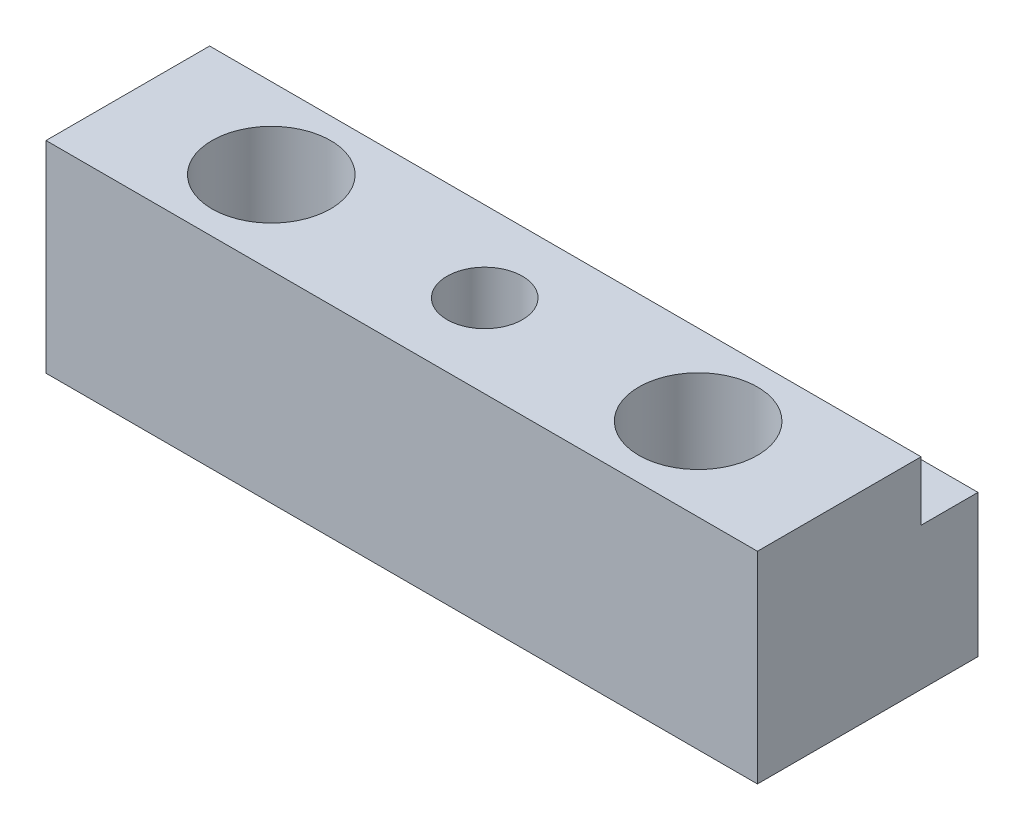
ISO-10303-21;
HEADER;
FILE_DESCRIPTION(('STEP AP214'),'2;1');
FILE_NAME('part.step','',(''),(''),'','','');
FILE_SCHEMA(('AUTOMOTIVE_DESIGN { 1 0 10303 214 1 1 1 1 }'));
ENDSEC;
DATA;
#1=APPLICATION_CONTEXT('core data for automotive mechanical design processes');
#2=APPLICATION_PROTOCOL_DEFINITION('international standard','automotive_design',2000,#1);
#3=PRODUCT_CONTEXT('',#1,'mechanical');
#4=PRODUCT('Part','Part','',(#3));
#5=PRODUCT_RELATED_PRODUCT_CATEGORY('part','',(#4));
#6=PRODUCT_DEFINITION_FORMATION('','',#4);
#7=PRODUCT_DEFINITION_CONTEXT('part definition',#1,'design');
#8=PRODUCT_DEFINITION('design','',#6,#7);
#9=PRODUCT_DEFINITION_SHAPE('','',#8);
#10=(LENGTH_UNIT() NAMED_UNIT(*) SI_UNIT(.MILLI.,.METRE.));
#11=(NAMED_UNIT(*) PLANE_ANGLE_UNIT() SI_UNIT($,.RADIAN.));
#12=(NAMED_UNIT(*) SI_UNIT($,.STERADIAN.) SOLID_ANGLE_UNIT());
#13=UNCERTAINTY_MEASURE_WITH_UNIT(LENGTH_MEASURE(1.E-05),#10,'distance_accuracy_value','');
#14=(GEOMETRIC_REPRESENTATION_CONTEXT(3) GLOBAL_UNCERTAINTY_ASSIGNED_CONTEXT((#13)) GLOBAL_UNIT_ASSIGNED_CONTEXT((#10,
#11,#12)) REPRESENTATION_CONTEXT('',''));
#15=CARTESIAN_POINT('',(0.,0.,0.));
#16=DIRECTION('',(0.,0.,1.));
#17=DIRECTION('',(1.,0.,0.));
#18=AXIS2_PLACEMENT_3D('',#15,#16,#17);
#19=CARTESIAN_POINT('',(0.,10.795,-11.811));
#20=DIRECTION('',(0.,0.,1.));
#21=DIRECTION('',(1.,0.,0.));
#22=AXIS2_PLACEMENT_3D('',#19,#20,#21);
#23=PLANE('',#22);
#24=DIRECTION('',(-1.,0.,0.));
#25=VECTOR('',#24,1.);
#26=CARTESIAN_POINT('',(0.,7.62,-11.811));
#27=LINE('',#26,#25);
#28=CARTESIAN_POINT('',(38.1,7.62,-11.811));
#29=VERTEX_POINT('',#28);
#30=CARTESIAN_POINT('',(0.,7.62,-11.811));
#31=VERTEX_POINT('',#30);
#32=EDGE_CURVE('E138',#29,#31,#27,.T.);
#33=ORIENTED_EDGE('',*,*,#32,.F.);
#34=DIRECTION('',(0.,-1.,0.));
#35=VECTOR('',#34,1.);
#36=CARTESIAN_POINT('',(38.1,10.795,-11.811));
#37=LINE('',#36,#35);
#38=CARTESIAN_POINT('',(38.1,0.,-11.811));
#39=VERTEX_POINT('',#38);
#40=EDGE_CURVE('E104',#29,#39,#37,.T.);
#41=ORIENTED_EDGE('',*,*,#40,.T.);
#42=DIRECTION('',(-1.,0.,0.));
#43=VECTOR('',#42,1.);
#44=CARTESIAN_POINT('',(0.,0.,-11.811));
#45=LINE('',#44,#43);
#46=CARTESIAN_POINT('',(0.,0.,-11.811));
#47=VERTEX_POINT('',#46);
#48=EDGE_CURVE('E108',#39,#47,#45,.T.);
#49=ORIENTED_EDGE('',*,*,#48,.T.);
#50=DIRECTION('',(0.,-1.,0.));
#51=VECTOR('',#50,1.);
#52=CARTESIAN_POINT('',(0.,10.795,-11.811));
#53=LINE('',#52,#51);
#54=EDGE_CURVE('E94',#31,#47,#53,.T.);
#55=ORIENTED_EDGE('',*,*,#54,.F.);
#56=EDGE_LOOP('',(#33,#41,#49,#55));
#57=FACE_BOUND('',#56,.T.);
#58=ADVANCED_FACE('F50',(#57),#23,.F.);
#59=CARTESIAN_POINT('',(0.,10.795,0.));
#60=DIRECTION('',(1.,0.,0.));
#61=DIRECTION('',(0.,0.,-1.));
#62=AXIS2_PLACEMENT_3D('',#59,#60,#61);
#63=PLANE('',#62);
#64=DIRECTION('',(0.,0.,1.));
#65=VECTOR('',#64,1.);
#66=CARTESIAN_POINT('',(0.,10.795,0.));
#67=LINE('',#66,#65);
#68=CARTESIAN_POINT('',(0.,10.795,-8.763));
#69=VERTEX_POINT('',#68);
#70=CARTESIAN_POINT('',(0.,10.795,0.));
#71=VERTEX_POINT('',#70);
#72=EDGE_CURVE('E114',#69,#71,#67,.T.);
#73=ORIENTED_EDGE('',*,*,#72,.F.);
#74=DIRECTION('',(0.,1.,0.));
#75=VECTOR('',#74,1.);
#76=CARTESIAN_POINT('',(0.,7.62,-8.763));
#77=LINE('',#76,#75);
#78=CARTESIAN_POINT('',(0.,7.62,-8.763));
#79=VERTEX_POINT('',#78);
#80=EDGE_CURVE('E65',#79,#69,#77,.T.);
#81=ORIENTED_EDGE('',*,*,#80,.F.);
#82=DIRECTION('',(0.,0.,1.));
#83=VECTOR('',#82,1.);
#84=CARTESIAN_POINT('',(0.,7.62,-11.811));
#85=LINE('',#84,#83);
#86=EDGE_CURVE('E101',#31,#79,#85,.T.);
#87=ORIENTED_EDGE('',*,*,#86,.F.);
#88=ORIENTED_EDGE('',*,*,#54,.T.);
#89=DIRECTION('',(0.,0.,1.));
#90=VECTOR('',#89,1.);
#91=CARTESIAN_POINT('',(0.,0.,0.));
#92=LINE('',#91,#90);
#93=CARTESIAN_POINT('',(0.,0.,0.));
#94=VERTEX_POINT('',#93);
#95=EDGE_CURVE('E99',#47,#94,#92,.T.);
#96=ORIENTED_EDGE('',*,*,#95,.T.);
#97=DIRECTION('',(0.,-1.,0.));
#98=VECTOR('',#97,1.);
#99=CARTESIAN_POINT('',(0.,10.795,0.));
#100=LINE('',#99,#98);
#101=EDGE_CURVE('E13',#71,#94,#100,.T.);
#102=ORIENTED_EDGE('',*,*,#101,.F.);
#103=EDGE_LOOP('',(#73,#81,#87,#88,#96,#102));
#104=FACE_BOUND('',#103,.T.);
#105=ADVANCED_FACE('F52',(#104),#63,.F.);
#106=CARTESIAN_POINT('',(0.,10.795,0.));
#107=DIRECTION('',(0.,0.,-1.));
#108=DIRECTION('',(-1.,0.,0.));
#109=AXIS2_PLACEMENT_3D('',#106,#107,#108);
#110=PLANE('',#109);
#111=DIRECTION('',(1.,0.,0.));
#112=VECTOR('',#111,1.);
#113=CARTESIAN_POINT('',(0.,0.,0.));
#114=LINE('',#113,#112);
#115=CARTESIAN_POINT('',(38.1,0.,0.));
#116=VERTEX_POINT('',#115);
#117=EDGE_CURVE('E118',#94,#116,#114,.T.);
#118=ORIENTED_EDGE('',*,*,#117,.T.);
#119=DIRECTION('',(0.,-1.,0.));
#120=VECTOR('',#119,1.);
#121=CARTESIAN_POINT('',(38.1,10.795,0.));
#122=LINE('',#121,#120);
#123=CARTESIAN_POINT('',(38.1,10.795,0.));
#124=VERTEX_POINT('',#123);
#125=EDGE_CURVE('E58',#124,#116,#122,.T.);
#126=ORIENTED_EDGE('',*,*,#125,.F.);
#127=DIRECTION('',(1.,0.,0.));
#128=VECTOR('',#127,1.);
#129=CARTESIAN_POINT('',(0.,10.795,0.));
#130=LINE('',#129,#128);
#131=EDGE_CURVE('E74',#71,#124,#130,.T.);
#132=ORIENTED_EDGE('',*,*,#131,.F.);
#133=ORIENTED_EDGE('',*,*,#101,.T.);
#134=EDGE_LOOP('',(#118,#126,#132,#133));
#135=FACE_BOUND('',#134,.T.);
#136=ADVANCED_FACE('F134',(#135),#110,.F.);
#137=CARTESIAN_POINT('',(38.1,10.795,0.));
#138=DIRECTION('',(-1.,0.,0.));
#139=DIRECTION('',(0.,0.,1.));
#140=AXIS2_PLACEMENT_3D('',#137,#138,#139);
#141=PLANE('',#140);
#142=DIRECTION('',(0.,0.,-1.));
#143=VECTOR('',#142,1.);
#144=CARTESIAN_POINT('',(38.1,7.62,-11.811));
#145=LINE('',#144,#143);
#146=CARTESIAN_POINT('',(38.1,7.62,-8.763));
#147=VERTEX_POINT('',#146);
#148=EDGE_CURVE('E146',#147,#29,#145,.T.);
#149=ORIENTED_EDGE('',*,*,#148,.F.);
#150=DIRECTION('',(0.,1.,0.));
#151=VECTOR('',#150,1.);
#152=CARTESIAN_POINT('',(38.1,7.62,-8.763));
#153=LINE('',#152,#151);
#154=CARTESIAN_POINT('',(38.1,10.795,-8.763));
#155=VERTEX_POINT('',#154);
#156=EDGE_CURVE('E119',#147,#155,#153,.T.);
#157=ORIENTED_EDGE('',*,*,#156,.T.);
#158=DIRECTION('',(0.,0.,-1.));
#159=VECTOR('',#158,1.);
#160=CARTESIAN_POINT('',(38.1,10.795,0.));
#161=LINE('',#160,#159);
#162=EDGE_CURVE('E105',#124,#155,#161,.T.);
#163=ORIENTED_EDGE('',*,*,#162,.F.);
#164=ORIENTED_EDGE('',*,*,#125,.T.);
#165=DIRECTION('',(0.,0.,-1.));
#166=VECTOR('',#165,1.);
#167=CARTESIAN_POINT('',(38.1,0.,0.));
#168=LINE('',#167,#166);
#169=EDGE_CURVE('E115',#116,#39,#168,.T.);
#170=ORIENTED_EDGE('',*,*,#169,.T.);
#171=ORIENTED_EDGE('',*,*,#40,.F.);
#172=EDGE_LOOP('',(#149,#157,#163,#164,#170,#171));
#173=FACE_BOUND('',#172,.T.);
#174=ADVANCED_FACE('F132',(#173),#141,.F.);
#175=CARTESIAN_POINT('',(0.,10.795,0.));
#176=DIRECTION('',(0.,-1.,0.));
#177=DIRECTION('',(0.,0.,-1.));
#178=AXIS2_PLACEMENT_3D('',#175,#176,#177);
#179=PLANE('',#178);
#180=CARTESIAN_POINT('',(19.05,10.795,-4.445));
#181=DIRECTION('',(0.,1.,0.));
#182=DIRECTION('',(0.,0.,1.));
#183=AXIS2_PLACEMENT_3D('',#180,#181,#182);
#184=CIRCLE('',#183,2.0193);
#185=CARTESIAN_POINT('',(19.05,10.795,-2.4257));
#186=VERTEX_POINT('',#185);
#187=EDGE_CURVE('E167',#186,#186,#184,.T.);
#188=ORIENTED_EDGE('',*,*,#187,.F.);
#189=EDGE_LOOP('',(#188));
#190=FACE_BOUND('',#189,.T.);
#191=CARTESIAN_POINT('',(7.62,10.795,-4.445));
#192=DIRECTION('',(0.,1.,0.));
#193=DIRECTION('',(0.,0.,1.));
#194=AXIS2_PLACEMENT_3D('',#191,#192,#193);
#195=CIRCLE('',#194,3.175);
#196=CARTESIAN_POINT('',(7.62,10.795,-1.27));
#197=VERTEX_POINT('',#196);
#198=EDGE_CURVE('E161',#197,#197,#195,.T.);
#199=ORIENTED_EDGE('',*,*,#198,.F.);
#200=EDGE_LOOP('',(#199));
#201=FACE_BOUND('',#200,.T.);
#202=CARTESIAN_POINT('',(30.48,10.795,-4.445));
#203=DIRECTION('',(0.,1.,0.));
#204=DIRECTION('',(0.,0.,1.));
#205=AXIS2_PLACEMENT_3D('',#202,#203,#204);
#206=CIRCLE('',#205,3.175);
#207=CARTESIAN_POINT('',(30.48,10.795,-1.27));
#208=VERTEX_POINT('',#207);
#209=EDGE_CURVE('E155',#208,#208,#206,.T.);
#210=ORIENTED_EDGE('',*,*,#209,.F.);
#211=EDGE_LOOP('',(#210));
#212=FACE_BOUND('',#211,.T.);
#213=ORIENTED_EDGE('',*,*,#162,.T.);
#214=DIRECTION('',(1.,0.,0.));
#215=VECTOR('',#214,1.);
#216=CARTESIAN_POINT('',(0.,10.795,-8.763));
#217=LINE('',#216,#215);
#218=EDGE_CURVE('E140',#69,#155,#217,.T.);
#219=ORIENTED_EDGE('',*,*,#218,.F.);
#220=ORIENTED_EDGE('',*,*,#72,.T.);
#221=ORIENTED_EDGE('',*,*,#131,.T.);
#222=EDGE_LOOP('',(#213,#219,#220,#221));
#223=FACE_BOUND('',#222,.T.);
#224=ADVANCED_FACE('F173',(#190,#201,#212,#223),#179,.F.);
#225=CARTESIAN_POINT('',(0.,0.,0.));
#226=DIRECTION('',(0.,-1.,0.));
#227=DIRECTION('',(0.,0.,-1.));
#228=AXIS2_PLACEMENT_3D('',#225,#226,#227);
#229=PLANE('',#228);
#230=CARTESIAN_POINT('',(19.05,0.,-4.445));
#231=DIRECTION('',(0.,1.,0.));
#232=DIRECTION('',(0.,0.,1.));
#233=AXIS2_PLACEMENT_3D('',#230,#231,#232);
#234=CIRCLE('',#233,2.0193);
#235=CARTESIAN_POINT('',(19.05,0.,-2.4257));
#236=VERTEX_POINT('',#235);
#237=EDGE_CURVE('E164',#236,#236,#234,.T.);
#238=ORIENTED_EDGE('',*,*,#237,.T.);
#239=EDGE_LOOP('',(#238));
#240=FACE_BOUND('',#239,.T.);
#241=CARTESIAN_POINT('',(7.62,0.,-4.445));
#242=DIRECTION('',(0.,1.,0.));
#243=DIRECTION('',(0.,0.,1.));
#244=AXIS2_PLACEMENT_3D('',#241,#242,#243);
#245=CIRCLE('',#244,3.175);
#246=CARTESIAN_POINT('',(7.62,0.,-1.27));
#247=VERTEX_POINT('',#246);
#248=EDGE_CURVE('E158',#247,#247,#245,.T.);
#249=ORIENTED_EDGE('',*,*,#248,.T.);
#250=EDGE_LOOP('',(#249));
#251=FACE_BOUND('',#250,.T.);
#252=CARTESIAN_POINT('',(30.48,0.,-4.445));
#253=DIRECTION('',(0.,1.,0.));
#254=DIRECTION('',(0.,0.,1.));
#255=AXIS2_PLACEMENT_3D('',#252,#253,#254);
#256=CIRCLE('',#255,3.175);
#257=CARTESIAN_POINT('',(30.48,0.,-1.27));
#258=VERTEX_POINT('',#257);
#259=EDGE_CURVE('E142',#258,#258,#256,.T.);
#260=ORIENTED_EDGE('',*,*,#259,.T.);
#261=EDGE_LOOP('',(#260));
#262=FACE_BOUND('',#261,.T.);
#263=ORIENTED_EDGE('',*,*,#95,.F.);
#264=ORIENTED_EDGE('',*,*,#48,.F.);
#265=ORIENTED_EDGE('',*,*,#169,.F.);
#266=ORIENTED_EDGE('',*,*,#117,.F.);
#267=EDGE_LOOP('',(#263,#264,#265,#266));
#268=FACE_BOUND('',#267,.T.);
#269=ADVANCED_FACE('F117',(#240,#251,#262,#268),#229,.T.);
#270=CARTESIAN_POINT('',(0.,7.62,-8.763));
#271=DIRECTION('',(0.,0.,1.));
#272=DIRECTION('',(1.,0.,0.));
#273=AXIS2_PLACEMENT_3D('',#270,#271,#272);
#274=PLANE('',#273);
#275=ORIENTED_EDGE('',*,*,#218,.T.);
#276=ORIENTED_EDGE('',*,*,#156,.F.);
#277=DIRECTION('',(1.,0.,0.));
#278=VECTOR('',#277,1.);
#279=CARTESIAN_POINT('',(0.,7.62,-8.763));
#280=LINE('',#279,#278);
#281=EDGE_CURVE('E149',#79,#147,#280,.T.);
#282=ORIENTED_EDGE('',*,*,#281,.F.);
#283=ORIENTED_EDGE('',*,*,#80,.T.);
#284=EDGE_LOOP('',(#275,#276,#282,#283));
#285=FACE_BOUND('',#284,.T.);
#286=ADVANCED_FACE('F188',(#285),#274,.F.);
#287=CARTESIAN_POINT('',(0.,7.62,0.));
#288=DIRECTION('',(0.,1.,0.));
#289=DIRECTION('',(0.,0.,1.));
#290=AXIS2_PLACEMENT_3D('',#287,#288,#289);
#291=PLANE('',#290);
#292=ORIENTED_EDGE('',*,*,#86,.T.);
#293=ORIENTED_EDGE('',*,*,#281,.T.);
#294=ORIENTED_EDGE('',*,*,#148,.T.);
#295=ORIENTED_EDGE('',*,*,#32,.T.);
#296=EDGE_LOOP('',(#292,#293,#294,#295));
#297=FACE_BOUND('',#296,.T.);
#298=ADVANCED_FACE('F190',(#297),#291,.T.);
#299=CARTESIAN_POINT('',(30.48,10.795,-4.445));
#300=DIRECTION('',(0.,1.,0.));
#301=DIRECTION('',(0.,0.,1.));
#302=AXIS2_PLACEMENT_3D('',#299,#300,#301);
#303=CYLINDRICAL_SURFACE('',#302,3.175);
#304=ORIENTED_EDGE('',*,*,#259,.F.);
#305=EDGE_LOOP('',(#304));
#306=FACE_BOUND('',#305,.T.);
#307=ORIENTED_EDGE('',*,*,#209,.T.);
#308=EDGE_LOOP('',(#307));
#309=FACE_BOUND('',#308,.T.);
#310=ADVANCED_FACE('F192',(#306,#309),#303,.F.);
#311=CARTESIAN_POINT('',(7.62,10.795,-4.445));
#312=DIRECTION('',(0.,1.,0.));
#313=DIRECTION('',(0.,0.,1.));
#314=AXIS2_PLACEMENT_3D('',#311,#312,#313);
#315=CYLINDRICAL_SURFACE('',#314,3.175);
#316=ORIENTED_EDGE('',*,*,#248,.F.);
#317=EDGE_LOOP('',(#316));
#318=FACE_BOUND('',#317,.T.);
#319=ORIENTED_EDGE('',*,*,#198,.T.);
#320=EDGE_LOOP('',(#319));
#321=FACE_BOUND('',#320,.T.);
#322=ADVANCED_FACE('F198',(#318,#321),#315,.F.);
#323=CARTESIAN_POINT('',(19.05,10.795,-4.445));
#324=DIRECTION('',(0.,1.,0.));
#325=DIRECTION('',(0.,0.,1.));
#326=AXIS2_PLACEMENT_3D('',#323,#324,#325);
#327=CYLINDRICAL_SURFACE('',#326,2.0193);
#328=ORIENTED_EDGE('',*,*,#237,.F.);
#329=EDGE_LOOP('',(#328));
#330=FACE_BOUND('',#329,.T.);
#331=ORIENTED_EDGE('',*,*,#187,.T.);
#332=EDGE_LOOP('',(#331));
#333=FACE_BOUND('',#332,.T.);
#334=ADVANCED_FACE('F171',(#330,#333),#327,.F.);
#335=CLOSED_SHELL('',(#58,#105,#136,#174,#224,#269,#286,#298,#310,#322,#334));
#336=MANIFOLD_SOLID_BREP('B2',#335);
#337=ADVANCED_BREP_SHAPE_REPRESENTATION('',(#18,#336),#14);
#338=SHAPE_DEFINITION_REPRESENTATION(#9,#337);
ENDSEC;
END-ISO-10303-21;
